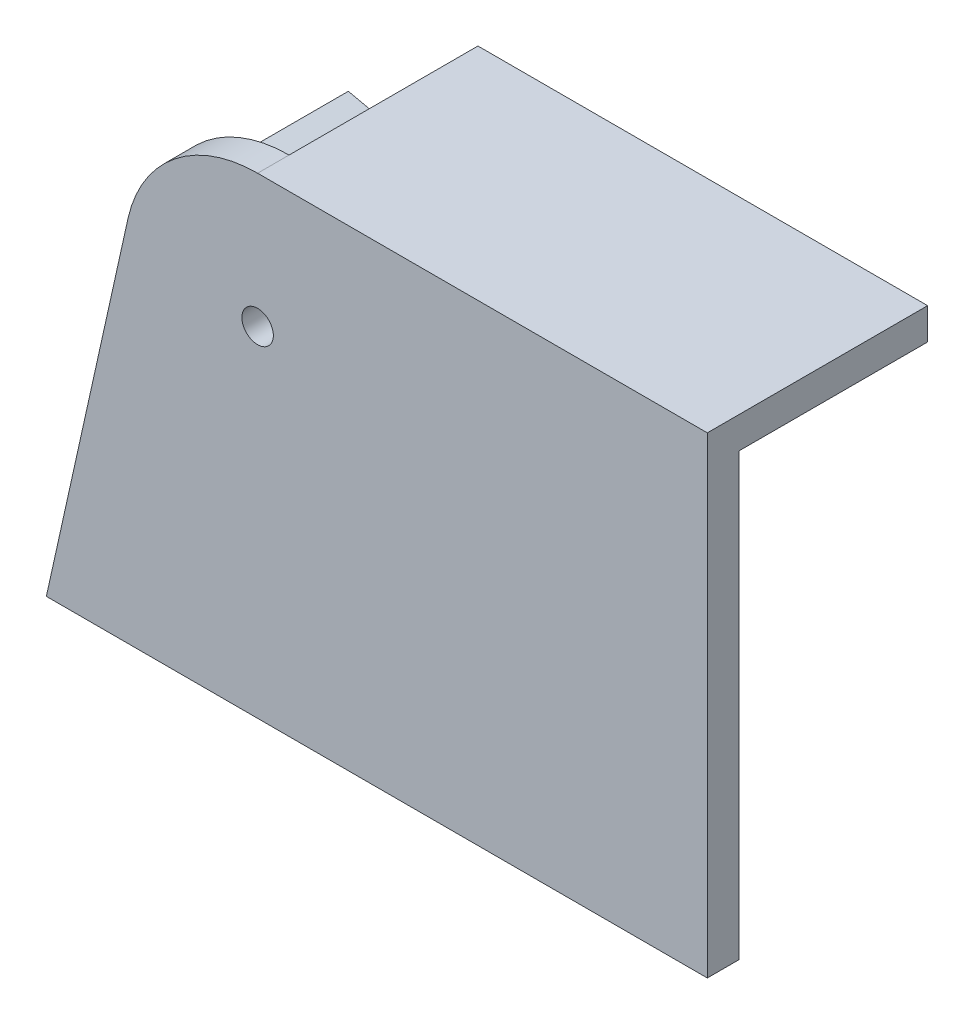
ISO-10303-21;
HEADER;
FILE_DESCRIPTION(('STEP AP214'),'2;1');
FILE_NAME('part.step','',(''),(''),'','','');
FILE_SCHEMA(('AUTOMOTIVE_DESIGN { 1 0 10303 214 1 1 1 1 }'));
ENDSEC;
DATA;
#1=APPLICATION_CONTEXT('core data for automotive mechanical design processes');
#2=APPLICATION_PROTOCOL_DEFINITION('international standard','automotive_design',2000,#1);
#3=PRODUCT_CONTEXT('',#1,'mechanical');
#4=PRODUCT('Part','Part','',(#3));
#5=PRODUCT_RELATED_PRODUCT_CATEGORY('part','',(#4));
#6=PRODUCT_DEFINITION_FORMATION('','',#4);
#7=PRODUCT_DEFINITION_CONTEXT('part definition',#1,'design');
#8=PRODUCT_DEFINITION('design','',#6,#7);
#9=PRODUCT_DEFINITION_SHAPE('','',#8);
#10=(LENGTH_UNIT() NAMED_UNIT(*) SI_UNIT(.MILLI.,.METRE.));
#11=(NAMED_UNIT(*) PLANE_ANGLE_UNIT() SI_UNIT($,.RADIAN.));
#12=(NAMED_UNIT(*) SI_UNIT($,.STERADIAN.) SOLID_ANGLE_UNIT());
#13=UNCERTAINTY_MEASURE_WITH_UNIT(LENGTH_MEASURE(1.E-05),#10,'distance_accuracy_value','');
#14=(GEOMETRIC_REPRESENTATION_CONTEXT(3) GLOBAL_UNCERTAINTY_ASSIGNED_CONTEXT((#13)) GLOBAL_UNIT_ASSIGNED_CONTEXT((#10,
#11,#12)) REPRESENTATION_CONTEXT('',''));
#15=CARTESIAN_POINT('',(0.,0.,0.));
#16=DIRECTION('',(0.,0.,1.));
#17=DIRECTION('',(1.,0.,0.));
#18=AXIS2_PLACEMENT_3D('',#15,#16,#17);
#19=CARTESIAN_POINT('',(-71.44,53.91,5.));
#20=DIRECTION('',(0.,0.,1.));
#21=DIRECTION('',(1.,0.,0.));
#22=AXIS2_PLACEMENT_3D('',#19,#20,#21);
#23=PLANE('',#22);
#24=DIRECTION('',(0.,1.,0.));
#25=VECTOR('',#24,1.);
#26=CARTESIAN_POINT('',(0.,0.,5.));
#27=LINE('',#26,#25);
#28=CARTESIAN_POINT('',(0.,0.,5.));
#29=VERTEX_POINT('',#28);
#30=CARTESIAN_POINT('',(0.,75.,5.));
#31=VERTEX_POINT('',#30);
#32=EDGE_CURVE('E78',#29,#31,#27,.T.);
#33=ORIENTED_EDGE('',*,*,#32,.T.);
#34=DIRECTION('',(-1.,0.,0.));
#35=VECTOR('',#34,1.);
#36=CARTESIAN_POINT('',(0.,75.,5.));
#37=LINE('',#36,#35);
#38=CARTESIAN_POINT('',(-71.44,75.,5.));
#39=VERTEX_POINT('',#38);
#40=EDGE_CURVE('E91',#31,#39,#37,.T.);
#41=ORIENTED_EDGE('',*,*,#40,.T.);
#42=CARTESIAN_POINT('',(-71.44,53.91,5.));
#43=DIRECTION('',(0.,0.,1.));
#44=DIRECTION('',(1.,0.,0.));
#45=AXIS2_PLACEMENT_3D('',#42,#43,#44);
#46=CIRCLE('',#45,21.09);
#47=CARTESIAN_POINT('',(-92.0296075576089,58.4768545656344,5.));
#48=VERTEX_POINT('',#47);
#49=EDGE_CURVE('E85',#39,#48,#46,.T.);
#50=ORIENTED_EDGE('',*,*,#49,.T.);
#51=DIRECTION('',(-0.216541231182288,-0.976273473570833,0.));
#52=VECTOR('',#51,1.);
#53=CARTESIAN_POINT('',(-92.0296075576089,58.4768545656344,5.));
#54=LINE('',#53,#52);
#55=CARTESIAN_POINT('',(-105.,0.,5.));
#56=VERTEX_POINT('',#55);
#57=EDGE_CURVE('E89',#48,#56,#54,.T.);
#58=ORIENTED_EDGE('',*,*,#57,.T.);
#59=DIRECTION('',(1.,0.,0.));
#60=VECTOR('',#59,1.);
#61=CARTESIAN_POINT('',(0.,0.,5.));
#62=LINE('',#61,#60);
#63=EDGE_CURVE('E57',#56,#29,#62,.T.);
#64=ORIENTED_EDGE('',*,*,#63,.T.);
#65=EDGE_LOOP('',(#33,#41,#50,#58,#64));
#66=FACE_BOUND('',#65,.T.);
#67=CARTESIAN_POINT('',(-71.44,53.91,5.));
#68=DIRECTION('',(0.,0.,1.));
#69=DIRECTION('',(1.,0.,0.));
#70=AXIS2_PLACEMENT_3D('',#67,#68,#69);
#71=CIRCLE('',#70,2.5);
#72=CARTESIAN_POINT('',(-68.94,53.91,5.));
#73=VERTEX_POINT('',#72);
#74=EDGE_CURVE('E117',#73,#73,#71,.T.);
#75=ORIENTED_EDGE('',*,*,#74,.F.);
#76=EDGE_LOOP('',(#75));
#77=FACE_BOUND('',#76,.T.);
#78=ADVANCED_FACE('F33',(#66,#77),#23,.T.);
#79=CARTESIAN_POINT('',(-71.44,53.91,0.));
#80=DIRECTION('',(0.,0.,1.));
#81=DIRECTION('',(1.,0.,0.));
#82=AXIS2_PLACEMENT_3D('',#79,#80,#81);
#83=PLANE('',#82);
#84=DIRECTION('',(0.,-1.,0.));
#85=VECTOR('',#84,1.);
#86=CARTESIAN_POINT('',(-71.44,53.91,0.));
#87=LINE('',#86,#85);
#88=CARTESIAN_POINT('',(-71.44,75.,0.));
#89=VERTEX_POINT('',#88);
#90=CARTESIAN_POINT('',(-71.44,70.,0.));
#91=VERTEX_POINT('',#90);
#92=EDGE_CURVE('E130',#89,#91,#87,.T.);
#93=ORIENTED_EDGE('',*,*,#92,.T.);
#94=DIRECTION('',(1.,0.,0.));
#95=VECTOR('',#94,1.);
#96=CARTESIAN_POINT('',(-71.44,70.,0.));
#97=LINE('',#96,#95);
#98=CARTESIAN_POINT('',(0.,70.,0.));
#99=VERTEX_POINT('',#98);
#100=EDGE_CURVE('E206',#91,#99,#97,.T.);
#101=ORIENTED_EDGE('',*,*,#100,.T.);
#102=DIRECTION('',(0.,1.,0.));
#103=VECTOR('',#102,1.);
#104=CARTESIAN_POINT('',(0.,0.,0.));
#105=LINE('',#104,#103);
#106=CARTESIAN_POINT('',(0.,0.,0.));
#107=VERTEX_POINT('',#106);
#108=EDGE_CURVE('E114',#107,#99,#105,.T.);
#109=ORIENTED_EDGE('',*,*,#108,.F.);
#110=DIRECTION('',(1.,0.,0.));
#111=VECTOR('',#110,1.);
#112=CARTESIAN_POINT('',(0.,0.,0.));
#113=LINE('',#112,#111);
#114=CARTESIAN_POINT('',(-99.8784842205003,0.,0.));
#115=VERTEX_POINT('',#114);
#116=EDGE_CURVE('E72',#115,#107,#113,.T.);
#117=ORIENTED_EDGE('',*,*,#116,.F.);
#118=DIRECTION('',(0.216541231182288,0.976273473570833,0.));
#119=VECTOR('',#118,1.);
#120=CARTESIAN_POINT('',(-87.1482401897547,57.394148409723,0.));
#121=LINE('',#120,#119);
#122=CARTESIAN_POINT('',(-87.1482401897547,57.394148409723,0.));
#123=VERTEX_POINT('',#122);
#124=EDGE_CURVE('E133',#115,#123,#121,.T.);
#125=ORIENTED_EDGE('',*,*,#124,.T.);
#126=DIRECTION('',(-0.976273473570833,0.216541231182288,0.));
#127=VECTOR('',#126,1.);
#128=CARTESIAN_POINT('',(-71.44,53.91,0.));
#129=LINE('',#128,#127);
#130=CARTESIAN_POINT('',(-92.0296075576089,58.4768545656344,0.));
#131=VERTEX_POINT('',#130);
#132=EDGE_CURVE('E132',#123,#131,#129,.T.);
#133=ORIENTED_EDGE('',*,*,#132,.T.);
#134=CARTESIAN_POINT('',(-71.44,53.91,0.));
#135=DIRECTION('',(0.,0.,1.));
#136=DIRECTION('',(1.,0.,0.));
#137=AXIS2_PLACEMENT_3D('',#134,#135,#136);
#138=CIRCLE('',#137,21.09);
#139=EDGE_CURVE('E101',#89,#131,#138,.T.);
#140=ORIENTED_EDGE('',*,*,#139,.F.);
#141=EDGE_LOOP('',(#93,#101,#109,#117,#125,#133,#140));
#142=FACE_BOUND('',#141,.T.);
#143=CARTESIAN_POINT('',(-71.44,53.91,0.));
#144=DIRECTION('',(0.,0.,1.));
#145=DIRECTION('',(1.,0.,0.));
#146=AXIS2_PLACEMENT_3D('',#143,#144,#145);
#147=CIRCLE('',#146,2.5);
#148=CARTESIAN_POINT('',(-68.94,53.91,0.));
#149=VERTEX_POINT('',#148);
#150=EDGE_CURVE('E137',#149,#149,#147,.T.);
#151=ORIENTED_EDGE('',*,*,#150,.T.);
#152=EDGE_LOOP('',(#151));
#153=FACE_BOUND('',#152,.T.);
#154=ADVANCED_FACE('F125',(#142,#153),#83,.F.);
#155=CARTESIAN_POINT('',(0.,0.,5.));
#156=DIRECTION('',(-1.,0.,0.));
#157=DIRECTION('',(0.,0.,1.));
#158=AXIS2_PLACEMENT_3D('',#155,#156,#157);
#159=PLANE('',#158);
#160=ORIENTED_EDGE('',*,*,#108,.T.);
#161=DIRECTION('',(0.,0.,1.));
#162=VECTOR('',#161,1.);
#163=CARTESIAN_POINT('',(0.,70.,-30.));
#164=LINE('',#163,#162);
#165=CARTESIAN_POINT('',(0.,70.,-30.));
#166=VERTEX_POINT('',#165);
#167=EDGE_CURVE('E193',#166,#99,#164,.T.);
#168=ORIENTED_EDGE('',*,*,#167,.F.);
#169=DIRECTION('',(0.,1.,0.));
#170=VECTOR('',#169,1.);
#171=CARTESIAN_POINT('',(0.,75.,-30.));
#172=LINE('',#171,#170);
#173=CARTESIAN_POINT('',(0.,75.,-30.));
#174=VERTEX_POINT('',#173);
#175=EDGE_CURVE('E186',#166,#174,#172,.T.);
#176=ORIENTED_EDGE('',*,*,#175,.T.);
#177=DIRECTION('',(0.,0.,-1.));
#178=VECTOR('',#177,1.);
#179=CARTESIAN_POINT('',(0.,75.,5.));
#180=LINE('',#179,#178);
#181=EDGE_CURVE('E11',#31,#174,#180,.T.);
#182=ORIENTED_EDGE('',*,*,#181,.F.);
#183=ORIENTED_EDGE('',*,*,#32,.F.);
#184=DIRECTION('',(0.,0.,-1.));
#185=VECTOR('',#184,1.);
#186=CARTESIAN_POINT('',(0.,0.,5.));
#187=LINE('',#186,#185);
#188=EDGE_CURVE('E110',#29,#107,#187,.T.);
#189=ORIENTED_EDGE('',*,*,#188,.T.);
#190=EDGE_LOOP('',(#160,#168,#176,#182,#183,#189));
#191=FACE_BOUND('',#190,.T.);
#192=ADVANCED_FACE('F35',(#191),#159,.F.);
#193=CARTESIAN_POINT('',(0.,75.,5.));
#194=DIRECTION('',(0.,-1.,0.));
#195=DIRECTION('',(1.,0.,0.));
#196=AXIS2_PLACEMENT_3D('',#193,#194,#195);
#197=PLANE('',#196);
#198=ORIENTED_EDGE('',*,*,#181,.T.);
#199=DIRECTION('',(-1.,0.,0.));
#200=VECTOR('',#199,1.);
#201=CARTESIAN_POINT('',(0.,75.,-30.));
#202=LINE('',#201,#200);
#203=CARTESIAN_POINT('',(-71.44,75.,-30.));
#204=VERTEX_POINT('',#203);
#205=EDGE_CURVE('E177',#174,#204,#202,.T.);
#206=ORIENTED_EDGE('',*,*,#205,.T.);
#207=DIRECTION('',(0.,0.,1.));
#208=VECTOR('',#207,1.);
#209=CARTESIAN_POINT('',(-71.44,75.,-30.));
#210=LINE('',#209,#208);
#211=EDGE_CURVE('E199',#204,#89,#210,.T.);
#212=ORIENTED_EDGE('',*,*,#211,.T.);
#213=DIRECTION('',(0.,0.,-1.));
#214=VECTOR('',#213,1.);
#215=CARTESIAN_POINT('',(-71.44,75.,5.));
#216=LINE('',#215,#214);
#217=EDGE_CURVE('E41',#39,#89,#216,.T.);
#218=ORIENTED_EDGE('',*,*,#217,.F.);
#219=ORIENTED_EDGE('',*,*,#40,.F.);
#220=EDGE_LOOP('',(#198,#206,#212,#218,#219));
#221=FACE_BOUND('',#220,.T.);
#222=ADVANCED_FACE('F166',(#221),#197,.F.);
#223=CARTESIAN_POINT('',(-71.44,53.91,5.));
#224=DIRECTION('',(0.,0.,-1.));
#225=DIRECTION('',(-1.,0.,0.));
#226=AXIS2_PLACEMENT_3D('',#223,#224,#225);
#227=CYLINDRICAL_SURFACE('',#226,21.09);
#228=ORIENTED_EDGE('',*,*,#139,.T.);
#229=DIRECTION('',(0.,0.,-1.));
#230=VECTOR('',#229,1.);
#231=CARTESIAN_POINT('',(-92.0296075576089,58.4768545656344,5.));
#232=LINE('',#231,#230);
#233=EDGE_CURVE('E98',#48,#131,#232,.T.);
#234=ORIENTED_EDGE('',*,*,#233,.F.);
#235=ORIENTED_EDGE('',*,*,#49,.F.);
#236=ORIENTED_EDGE('',*,*,#217,.T.);
#237=EDGE_LOOP('',(#228,#234,#235,#236));
#238=FACE_BOUND('',#237,.T.);
#239=ADVANCED_FACE('F99',(#238),#227,.T.);
#240=CARTESIAN_POINT('',(-92.0296075576089,58.4768545656344,5.));
#241=DIRECTION('',(0.976273473570833,-0.216541231182288,0.));
#242=DIRECTION('',(0.216541231182288,0.976273473570833,0.));
#243=AXIS2_PLACEMENT_3D('',#240,#241,#242);
#244=PLANE('',#243);
#245=ORIENTED_EDGE('',*,*,#233,.T.);
#246=DIRECTION('',(0.,0.,1.));
#247=VECTOR('',#246,1.);
#248=CARTESIAN_POINT('',(-92.0296075576089,58.4768545656344,-30.));
#249=LINE('',#248,#247);
#250=CARTESIAN_POINT('',(-92.0296075576089,58.4768545656344,-30.));
#251=VERTEX_POINT('',#250);
#252=EDGE_CURVE('E141',#251,#131,#249,.T.);
#253=ORIENTED_EDGE('',*,*,#252,.F.);
#254=DIRECTION('',(-0.216541231182288,-0.976273473570833,0.));
#255=VECTOR('',#254,1.);
#256=CARTESIAN_POINT('',(-105.,0.,-30.));
#257=LINE('',#256,#255);
#258=CARTESIAN_POINT('',(-105.,0.,-30.));
#259=VERTEX_POINT('',#258);
#260=EDGE_CURVE('E216',#251,#259,#257,.T.);
#261=ORIENTED_EDGE('',*,*,#260,.T.);
#262=DIRECTION('',(0.,0.,-1.));
#263=VECTOR('',#262,1.);
#264=CARTESIAN_POINT('',(-105.,0.,5.));
#265=LINE('',#264,#263);
#266=EDGE_CURVE('E104',#56,#259,#265,.T.);
#267=ORIENTED_EDGE('',*,*,#266,.F.);
#268=ORIENTED_EDGE('',*,*,#57,.F.);
#269=EDGE_LOOP('',(#245,#253,#261,#267,#268));
#270=FACE_BOUND('',#269,.T.);
#271=ADVANCED_FACE('F106',(#270),#244,.F.);
#272=CARTESIAN_POINT('',(0.,0.,5.));
#273=DIRECTION('',(0.,1.,0.));
#274=DIRECTION('',(-1.,0.,0.));
#275=AXIS2_PLACEMENT_3D('',#272,#273,#274);
#276=PLANE('',#275);
#277=ORIENTED_EDGE('',*,*,#188,.F.);
#278=ORIENTED_EDGE('',*,*,#63,.F.);
#279=ORIENTED_EDGE('',*,*,#266,.T.);
#280=DIRECTION('',(1.,0.,0.));
#281=VECTOR('',#280,1.);
#282=CARTESIAN_POINT('',(-99.8784842205003,0.,-30.));
#283=LINE('',#282,#281);
#284=CARTESIAN_POINT('',(-99.8784842205003,0.,-30.));
#285=VERTEX_POINT('',#284);
#286=EDGE_CURVE('E208',#259,#285,#283,.T.);
#287=ORIENTED_EDGE('',*,*,#286,.T.);
#288=DIRECTION('',(0.,0.,1.));
#289=VECTOR('',#288,1.);
#290=CARTESIAN_POINT('',(-99.8784842205003,0.,-30.));
#291=LINE('',#290,#289);
#292=EDGE_CURVE('E218',#285,#115,#291,.T.);
#293=ORIENTED_EDGE('',*,*,#292,.T.);
#294=ORIENTED_EDGE('',*,*,#116,.T.);
#295=EDGE_LOOP('',(#277,#278,#279,#287,#293,#294));
#296=FACE_BOUND('',#295,.T.);
#297=ADVANCED_FACE('F160',(#296),#276,.F.);
#298=CARTESIAN_POINT('',(-71.44,53.91,5.));
#299=DIRECTION('',(0.,0.,-1.));
#300=DIRECTION('',(-1.,0.,0.));
#301=AXIS2_PLACEMENT_3D('',#298,#299,#300);
#302=CYLINDRICAL_SURFACE('',#301,2.5);
#303=ORIENTED_EDGE('',*,*,#74,.T.);
#304=EDGE_LOOP('',(#303));
#305=FACE_BOUND('',#304,.T.);
#306=ORIENTED_EDGE('',*,*,#150,.F.);
#307=EDGE_LOOP('',(#306));
#308=FACE_BOUND('',#307,.T.);
#309=ADVANCED_FACE('F149',(#305,#308),#302,.F.);
#310=CARTESIAN_POINT('',(-92.0296075576089,58.4768545656344,-30.));
#311=DIRECTION('',(0.216541231182288,0.976273473570833,0.));
#312=DIRECTION('',(-0.976273473570833,0.216541231182288,0.));
#313=AXIS2_PLACEMENT_3D('',#310,#311,#312);
#314=PLANE('',#313);
#315=ORIENTED_EDGE('',*,*,#132,.F.);
#316=DIRECTION('',(0.,0.,1.));
#317=VECTOR('',#316,1.);
#318=CARTESIAN_POINT('',(-87.1482401897547,57.394148409723,-30.));
#319=LINE('',#318,#317);
#320=CARTESIAN_POINT('',(-87.1482401897547,57.394148409723,-30.));
#321=VERTEX_POINT('',#320);
#322=EDGE_CURVE('E48',#321,#123,#319,.T.);
#323=ORIENTED_EDGE('',*,*,#322,.F.);
#324=DIRECTION('',(-0.976273473570832,0.216541231182288,0.));
#325=VECTOR('',#324,1.);
#326=CARTESIAN_POINT('',(-92.0296075576089,58.4768545656344,-30.));
#327=LINE('',#326,#325);
#328=EDGE_CURVE('E213',#321,#251,#327,.T.);
#329=ORIENTED_EDGE('',*,*,#328,.T.);
#330=ORIENTED_EDGE('',*,*,#252,.T.);
#331=EDGE_LOOP('',(#315,#323,#329,#330));
#332=FACE_BOUND('',#331,.T.);
#333=ADVANCED_FACE('F242',(#332),#314,.T.);
#334=CARTESIAN_POINT('',(-87.1482401897547,57.394148409723,-30.));
#335=DIRECTION('',(0.976273473570833,-0.216541231182288,0.));
#336=DIRECTION('',(0.216541231182288,0.976273473570833,0.));
#337=AXIS2_PLACEMENT_3D('',#334,#335,#336);
#338=PLANE('',#337);
#339=ORIENTED_EDGE('',*,*,#124,.F.);
#340=ORIENTED_EDGE('',*,*,#292,.F.);
#341=DIRECTION('',(0.216541231182288,0.976273473570833,0.));
#342=VECTOR('',#341,1.);
#343=CARTESIAN_POINT('',(-87.1482401897547,57.394148409723,-30.));
#344=LINE('',#343,#342);
#345=EDGE_CURVE('E211',#285,#321,#344,.T.);
#346=ORIENTED_EDGE('',*,*,#345,.T.);
#347=ORIENTED_EDGE('',*,*,#322,.T.);
#348=EDGE_LOOP('',(#339,#340,#346,#347));
#349=FACE_BOUND('',#348,.T.);
#350=ADVANCED_FACE('F243',(#349),#338,.T.);
#351=CARTESIAN_POINT('',(0.,0.,-30.));
#352=DIRECTION('',(0.,0.,-1.));
#353=DIRECTION('',(-1.,0.,0.));
#354=AXIS2_PLACEMENT_3D('',#351,#352,#353);
#355=PLANE('',#354);
#356=ORIENTED_EDGE('',*,*,#286,.F.);
#357=ORIENTED_EDGE('',*,*,#260,.F.);
#358=ORIENTED_EDGE('',*,*,#328,.F.);
#359=ORIENTED_EDGE('',*,*,#345,.F.);
#360=EDGE_LOOP('',(#356,#357,#358,#359));
#361=FACE_BOUND('',#360,.T.);
#362=ADVANCED_FACE('F240',(#361),#355,.T.);
#363=CARTESIAN_POINT('',(0.,70.,-30.));
#364=DIRECTION('',(0.,-1.,0.));
#365=DIRECTION('',(1.,0.,0.));
#366=AXIS2_PLACEMENT_3D('',#363,#364,#365);
#367=PLANE('',#366);
#368=ORIENTED_EDGE('',*,*,#100,.F.);
#369=DIRECTION('',(0.,0.,1.));
#370=VECTOR('',#369,1.);
#371=CARTESIAN_POINT('',(-71.44,70.,-30.));
#372=LINE('',#371,#370);
#373=CARTESIAN_POINT('',(-71.44,70.,-30.));
#374=VERTEX_POINT('',#373);
#375=EDGE_CURVE('E201',#374,#91,#372,.T.);
#376=ORIENTED_EDGE('',*,*,#375,.F.);
#377=DIRECTION('',(1.,0.,0.));
#378=VECTOR('',#377,1.);
#379=CARTESIAN_POINT('',(0.,70.,-30.));
#380=LINE('',#379,#378);
#381=EDGE_CURVE('E197',#374,#166,#380,.T.);
#382=ORIENTED_EDGE('',*,*,#381,.T.);
#383=ORIENTED_EDGE('',*,*,#167,.T.);
#384=EDGE_LOOP('',(#368,#376,#382,#383));
#385=FACE_BOUND('',#384,.T.);
#386=ADVANCED_FACE('F249',(#385),#367,.T.);
#387=CARTESIAN_POINT('',(-71.44,75.,-30.));
#388=DIRECTION('',(-1.,0.,0.));
#389=DIRECTION('',(0.,0.,1.));
#390=AXIS2_PLACEMENT_3D('',#387,#388,#389);
#391=PLANE('',#390);
#392=ORIENTED_EDGE('',*,*,#92,.F.);
#393=ORIENTED_EDGE('',*,*,#211,.F.);
#394=DIRECTION('',(0.,-1.,0.));
#395=VECTOR('',#394,1.);
#396=CARTESIAN_POINT('',(-71.44,75.,-30.));
#397=LINE('',#396,#395);
#398=EDGE_CURVE('E189',#204,#374,#397,.T.);
#399=ORIENTED_EDGE('',*,*,#398,.T.);
#400=ORIENTED_EDGE('',*,*,#375,.T.);
#401=EDGE_LOOP('',(#392,#393,#399,#400));
#402=FACE_BOUND('',#401,.T.);
#403=ADVANCED_FACE('F253',(#402),#391,.T.);
#404=CARTESIAN_POINT('',(0.,0.,-30.));
#405=DIRECTION('',(0.,0.,-1.));
#406=DIRECTION('',(-1.,0.,0.));
#407=AXIS2_PLACEMENT_3D('',#404,#405,#406);
#408=PLANE('',#407);
#409=ORIENTED_EDGE('',*,*,#175,.F.);
#410=ORIENTED_EDGE('',*,*,#381,.F.);
#411=ORIENTED_EDGE('',*,*,#398,.F.);
#412=ORIENTED_EDGE('',*,*,#205,.F.);
#413=EDGE_LOOP('',(#409,#410,#411,#412));
#414=FACE_BOUND('',#413,.T.);
#415=ADVANCED_FACE('F183',(#414),#408,.T.);
#416=CLOSED_SHELL('',(#78,#154,#192,#222,#239,#271,#297,#309,#333,#350,#362,#386,#403,#415));
#417=MANIFOLD_SOLID_BREP('B2',#416);
#418=ADVANCED_BREP_SHAPE_REPRESENTATION('',(#18,#417),#14);
#419=SHAPE_DEFINITION_REPRESENTATION(#9,#418);
ENDSEC;
END-ISO-10303-21;
